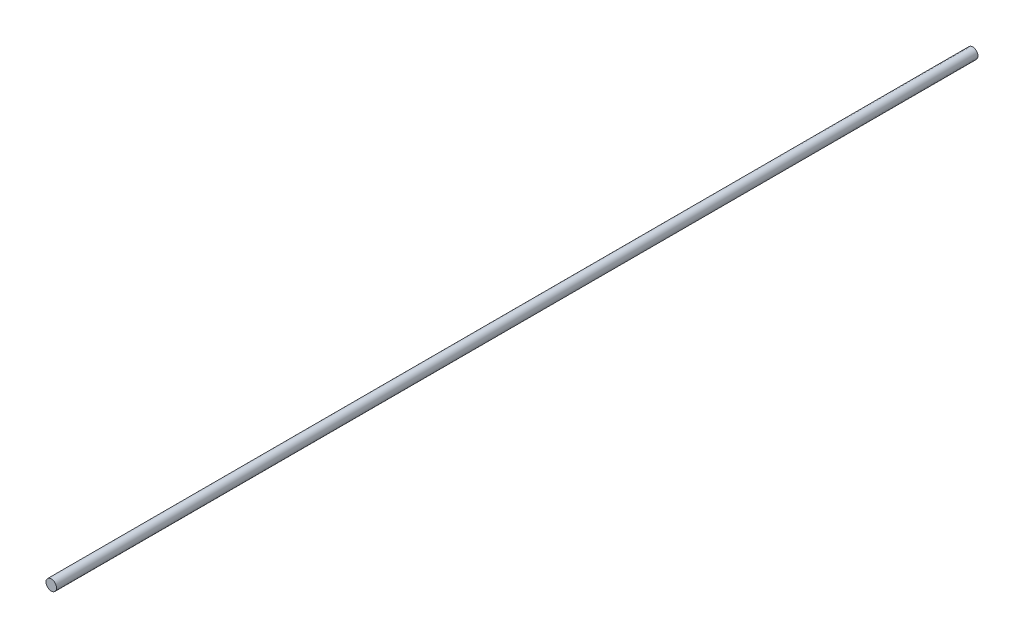
ISO-10303-21;
HEADER;
FILE_DESCRIPTION(('STEP AP214'),'2;1');
FILE_NAME('part.step','',(''),(''),'','','');
FILE_SCHEMA(('AUTOMOTIVE_DESIGN { 1 0 10303 214 1 1 1 1 }'));
ENDSEC;
DATA;
#1=APPLICATION_CONTEXT('core data for automotive mechanical design processes');
#2=APPLICATION_PROTOCOL_DEFINITION('international standard','automotive_design',2000,#1);
#3=PRODUCT_CONTEXT('',#1,'mechanical');
#4=PRODUCT('Part','Part','',(#3));
#5=PRODUCT_RELATED_PRODUCT_CATEGORY('part','',(#4));
#6=PRODUCT_DEFINITION_FORMATION('','',#4);
#7=PRODUCT_DEFINITION_CONTEXT('part definition',#1,'design');
#8=PRODUCT_DEFINITION('design','',#6,#7);
#9=PRODUCT_DEFINITION_SHAPE('','',#8);
#10=(LENGTH_UNIT() NAMED_UNIT(*) SI_UNIT(.MILLI.,.METRE.));
#11=(NAMED_UNIT(*) PLANE_ANGLE_UNIT() SI_UNIT($,.RADIAN.));
#12=(NAMED_UNIT(*) SI_UNIT($,.STERADIAN.) SOLID_ANGLE_UNIT());
#13=UNCERTAINTY_MEASURE_WITH_UNIT(LENGTH_MEASURE(1.E-05),#10,'distance_accuracy_value','');
#14=(GEOMETRIC_REPRESENTATION_CONTEXT(3) GLOBAL_UNCERTAINTY_ASSIGNED_CONTEXT((#13)) GLOBAL_UNIT_ASSIGNED_CONTEXT((#10,
#11,#12)) REPRESENTATION_CONTEXT('',''));
#15=CARTESIAN_POINT('',(0.,0.,0.));
#16=DIRECTION('',(0.,0.,1.));
#17=DIRECTION('',(1.,0.,0.));
#18=AXIS2_PLACEMENT_3D('',#15,#16,#17);
#19=CARTESIAN_POINT('',(0.,0.,22.225));
#20=DIRECTION('',(0.,0.,-1.));
#21=DIRECTION('',(-1.,0.,0.));
#22=AXIS2_PLACEMENT_3D('',#19,#20,#21);
#23=CYLINDRICAL_SURFACE('',#22,0.254);
#24=CARTESIAN_POINT('',(0.,0.,22.225));
#25=DIRECTION('',(0.,0.,1.));
#26=DIRECTION('',(1.,0.,0.));
#27=AXIS2_PLACEMENT_3D('',#24,#25,#26);
#28=CIRCLE('',#27,0.254);
#29=CARTESIAN_POINT('',(0.254,0.,22.225));
#30=VERTEX_POINT('',#29);
#31=EDGE_CURVE('E10',#30,#30,#28,.T.);
#32=ORIENTED_EDGE('',*,*,#31,.F.);
#33=EDGE_LOOP('',(#32));
#34=FACE_BOUND('',#33,.T.);
#35=CARTESIAN_POINT('',(0.,0.,-22.225));
#36=DIRECTION('',(0.,0.,1.));
#37=DIRECTION('',(1.,0.,0.));
#38=AXIS2_PLACEMENT_3D('',#35,#36,#37);
#39=CIRCLE('',#38,0.254);
#40=CARTESIAN_POINT('',(0.254,0.,-22.225));
#41=VERTEX_POINT('',#40);
#42=EDGE_CURVE('E31',#41,#41,#39,.T.);
#43=ORIENTED_EDGE('',*,*,#42,.T.);
#44=EDGE_LOOP('',(#43));
#45=FACE_BOUND('',#44,.T.);
#46=ADVANCED_FACE('F28',(#34,#45),#23,.T.);
#47=CARTESIAN_POINT('',(0.,0.,22.225));
#48=DIRECTION('',(0.,0.,1.));
#49=DIRECTION('',(1.,0.,0.));
#50=AXIS2_PLACEMENT_3D('',#47,#48,#49);
#51=PLANE('',#50);
#52=ORIENTED_EDGE('',*,*,#31,.T.);
#53=EDGE_LOOP('',(#52));
#54=FACE_BOUND('',#53,.T.);
#55=ADVANCED_FACE('F43',(#54),#51,.T.);
#56=CARTESIAN_POINT('',(0.,0.,-22.225));
#57=DIRECTION('',(0.,0.,1.));
#58=DIRECTION('',(1.,0.,0.));
#59=AXIS2_PLACEMENT_3D('',#56,#57,#58);
#60=PLANE('',#59);
#61=ORIENTED_EDGE('',*,*,#42,.F.);
#62=EDGE_LOOP('',(#61));
#63=FACE_BOUND('',#62,.T.);
#64=ADVANCED_FACE('F41',(#63),#60,.F.);
#65=CLOSED_SHELL('',(#46,#55,#64));
#66=MANIFOLD_SOLID_BREP('B2',#65);
#67=ADVANCED_BREP_SHAPE_REPRESENTATION('',(#18,#66),#14);
#68=SHAPE_DEFINITION_REPRESENTATION(#9,#67);
ENDSEC;
END-ISO-10303-21;
